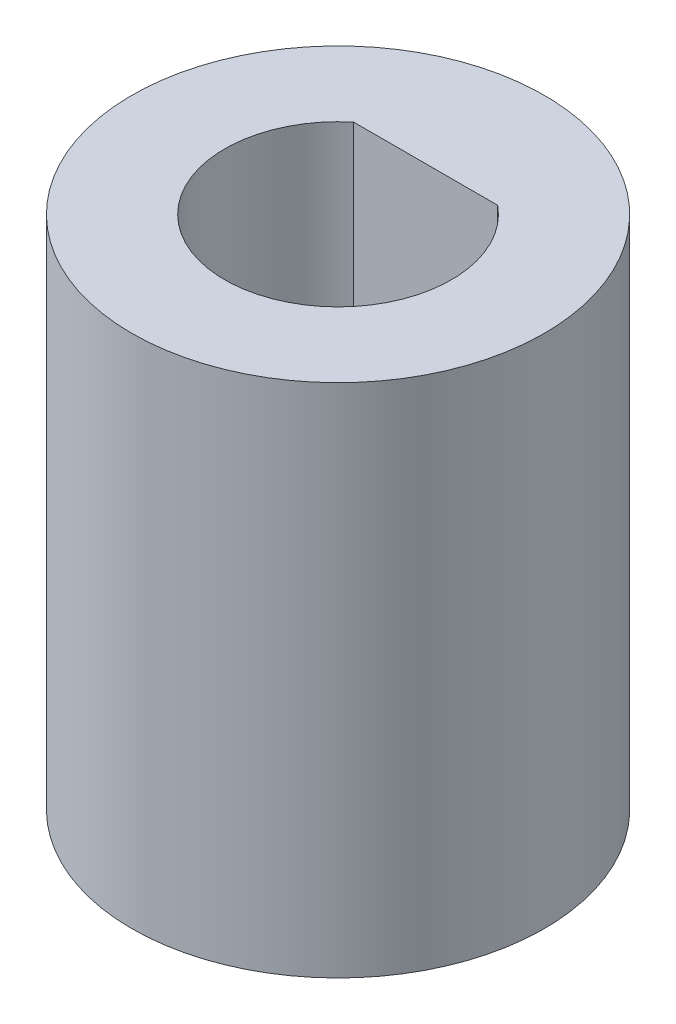
ISO-10303-21;
HEADER;
FILE_DESCRIPTION(('STEP AP214'),'2;1');
FILE_NAME('part.step','',(''),(''),'','','');
FILE_SCHEMA(('AUTOMOTIVE_DESIGN { 1 0 10303 214 1 1 1 1 }'));
ENDSEC;
DATA;
#1=APPLICATION_CONTEXT('core data for automotive mechanical design processes');
#2=APPLICATION_PROTOCOL_DEFINITION('international standard','automotive_design',2000,#1);
#3=PRODUCT_CONTEXT('',#1,'mechanical');
#4=PRODUCT('Part','Part','',(#3));
#5=PRODUCT_RELATED_PRODUCT_CATEGORY('part','',(#4));
#6=PRODUCT_DEFINITION_FORMATION('','',#4);
#7=PRODUCT_DEFINITION_CONTEXT('part definition',#1,'design');
#8=PRODUCT_DEFINITION('design','',#6,#7);
#9=PRODUCT_DEFINITION_SHAPE('','',#8);
#10=(LENGTH_UNIT() NAMED_UNIT(*) SI_UNIT(.MILLI.,.METRE.));
#11=(NAMED_UNIT(*) PLANE_ANGLE_UNIT() SI_UNIT($,.RADIAN.));
#12=(NAMED_UNIT(*) SI_UNIT($,.STERADIAN.) SOLID_ANGLE_UNIT());
#13=UNCERTAINTY_MEASURE_WITH_UNIT(LENGTH_MEASURE(1.E-05),#10,'distance_accuracy_value','');
#14=(GEOMETRIC_REPRESENTATION_CONTEXT(3) GLOBAL_UNCERTAINTY_ASSIGNED_CONTEXT((#13)) GLOBAL_UNIT_ASSIGNED_CONTEXT((#10,
#11,#12)) REPRESENTATION_CONTEXT('',''));
#15=CARTESIAN_POINT('',(0.,0.,0.));
#16=DIRECTION('',(0.,0.,1.));
#17=DIRECTION('',(1.,0.,0.));
#18=AXIS2_PLACEMENT_3D('',#15,#16,#17);
#19=CARTESIAN_POINT('',(0.,10.,0.));
#20=DIRECTION('',(0.,-1.,0.));
#21=DIRECTION('',(0.,0.,-1.));
#22=AXIS2_PLACEMENT_3D('',#19,#20,#21);
#23=CYLINDRICAL_SURFACE('',#22,2.2);
#24=CARTESIAN_POINT('',(0.,0.,0.));
#25=DIRECTION('',(0.,1.,0.));
#26=DIRECTION('',(0.,0.,1.));
#27=AXIS2_PLACEMENT_3D('',#24,#25,#26);
#28=CIRCLE('',#27,2.2);
#29=CARTESIAN_POINT('',(-1.39642400437689,0.,-1.7));
#30=VERTEX_POINT('',#29);
#31=CARTESIAN_POINT('',(1.39642400437689,0.,-1.7));
#32=VERTEX_POINT('',#31);
#33=EDGE_CURVE('E70',#30,#32,#28,.T.);
#34=ORIENTED_EDGE('',*,*,#33,.F.);
#35=DIRECTION('',(0.,-1.,0.));
#36=VECTOR('',#35,1.);
#37=CARTESIAN_POINT('',(-1.39642400437689,10.,-1.7));
#38=LINE('',#37,#36);
#39=CARTESIAN_POINT('',(-1.39642400437689,10.,-1.7));
#40=VERTEX_POINT('',#39);
#41=EDGE_CURVE('E11',#40,#30,#38,.T.);
#42=ORIENTED_EDGE('',*,*,#41,.F.);
#43=CARTESIAN_POINT('',(0.,10.,0.));
#44=DIRECTION('',(0.,1.,0.));
#45=DIRECTION('',(0.,0.,1.));
#46=AXIS2_PLACEMENT_3D('',#43,#44,#45);
#47=CIRCLE('',#46,2.2);
#48=CARTESIAN_POINT('',(1.39642400437689,10.,-1.7));
#49=VERTEX_POINT('',#48);
#50=EDGE_CURVE('E71',#40,#49,#47,.T.);
#51=ORIENTED_EDGE('',*,*,#50,.T.);
#52=DIRECTION('',(0.,-1.,0.));
#53=VECTOR('',#52,1.);
#54=CARTESIAN_POINT('',(1.39642400437689,10.,-1.7));
#55=LINE('',#54,#53);
#56=EDGE_CURVE('E50',#49,#32,#55,.T.);
#57=ORIENTED_EDGE('',*,*,#56,.T.);
#58=EDGE_LOOP('',(#34,#42,#51,#57));
#59=FACE_BOUND('',#58,.T.);
#60=ADVANCED_FACE('F41',(#59),#23,.F.);
#61=CARTESIAN_POINT('',(0.,10.,-1.7));
#62=DIRECTION('',(0.,0.,-1.));
#63=DIRECTION('',(-1.,0.,0.));
#64=AXIS2_PLACEMENT_3D('',#61,#62,#63);
#65=PLANE('',#64);
#66=DIRECTION('',(1.,0.,0.));
#67=VECTOR('',#66,1.);
#68=CARTESIAN_POINT('',(0.,0.,-1.7));
#69=LINE('',#68,#67);
#70=EDGE_CURVE('E74',#30,#32,#69,.T.);
#71=ORIENTED_EDGE('',*,*,#70,.T.);
#72=ORIENTED_EDGE('',*,*,#56,.F.);
#73=DIRECTION('',(1.,0.,0.));
#74=VECTOR('',#73,1.);
#75=CARTESIAN_POINT('',(0.,10.,-1.7));
#76=LINE('',#75,#74);
#77=EDGE_CURVE('E57',#40,#49,#76,.T.);
#78=ORIENTED_EDGE('',*,*,#77,.F.);
#79=ORIENTED_EDGE('',*,*,#41,.T.);
#80=EDGE_LOOP('',(#71,#72,#78,#79));
#81=FACE_BOUND('',#80,.T.);
#82=ADVANCED_FACE('F75',(#81),#65,.F.);
#83=CARTESIAN_POINT('',(0.,10.,0.));
#84=DIRECTION('',(0.,-1.,0.));
#85=DIRECTION('',(0.,0.,-1.));
#86=AXIS2_PLACEMENT_3D('',#83,#84,#85);
#87=CYLINDRICAL_SURFACE('',#86,4.);
#88=CARTESIAN_POINT('',(0.,10.,0.));
#89=DIRECTION('',(0.,1.,0.));
#90=DIRECTION('',(0.,0.,1.));
#91=AXIS2_PLACEMENT_3D('',#88,#89,#90);
#92=CIRCLE('',#91,4.);
#93=CARTESIAN_POINT('',(0.,10.,4.));
#94=VERTEX_POINT('',#93);
#95=EDGE_CURVE('E73',#94,#94,#92,.T.);
#96=ORIENTED_EDGE('',*,*,#95,.F.);
#97=EDGE_LOOP('',(#96));
#98=FACE_BOUND('',#97,.T.);
#99=CARTESIAN_POINT('',(0.,0.,0.));
#100=DIRECTION('',(0.,1.,0.));
#101=DIRECTION('',(0.,0.,1.));
#102=AXIS2_PLACEMENT_3D('',#99,#100,#101);
#103=CIRCLE('',#102,4.);
#104=CARTESIAN_POINT('',(0.,0.,4.));
#105=VERTEX_POINT('',#104);
#106=EDGE_CURVE('E78',#105,#105,#103,.T.);
#107=ORIENTED_EDGE('',*,*,#106,.T.);
#108=EDGE_LOOP('',(#107));
#109=FACE_BOUND('',#108,.T.);
#110=ADVANCED_FACE('F100',(#98,#109),#87,.T.);
#111=CARTESIAN_POINT('',(0.,10.,0.));
#112=DIRECTION('',(0.,1.,0.));
#113=DIRECTION('',(0.,0.,1.));
#114=AXIS2_PLACEMENT_3D('',#111,#112,#113);
#115=PLANE('',#114);
#116=ORIENTED_EDGE('',*,*,#50,.F.);
#117=ORIENTED_EDGE('',*,*,#77,.T.);
#118=EDGE_LOOP('',(#116,#117));
#119=FACE_BOUND('',#118,.T.);
#120=ORIENTED_EDGE('',*,*,#95,.T.);
#121=EDGE_LOOP('',(#120));
#122=FACE_BOUND('',#121,.T.);
#123=ADVANCED_FACE('F98',(#119,#122),#115,.T.);
#124=CARTESIAN_POINT('',(0.,0.,0.));
#125=DIRECTION('',(0.,1.,0.));
#126=DIRECTION('',(0.,0.,1.));
#127=AXIS2_PLACEMENT_3D('',#124,#125,#126);
#128=PLANE('',#127);
#129=ORIENTED_EDGE('',*,*,#33,.T.);
#130=ORIENTED_EDGE('',*,*,#70,.F.);
#131=EDGE_LOOP('',(#129,#130));
#132=FACE_BOUND('',#131,.T.);
#133=ORIENTED_EDGE('',*,*,#106,.F.);
#134=EDGE_LOOP('',(#133));
#135=FACE_BOUND('',#134,.T.);
#136=ADVANCED_FACE('F80',(#132,#135),#128,.F.);
#137=CLOSED_SHELL('',(#60,#82,#110,#123,#136));
#138=MANIFOLD_SOLID_BREP('B2',#137);
#139=ADVANCED_BREP_SHAPE_REPRESENTATION('',(#18,#138),#14);
#140=SHAPE_DEFINITION_REPRESENTATION(#9,#139);
ENDSEC;
END-ISO-10303-21;
